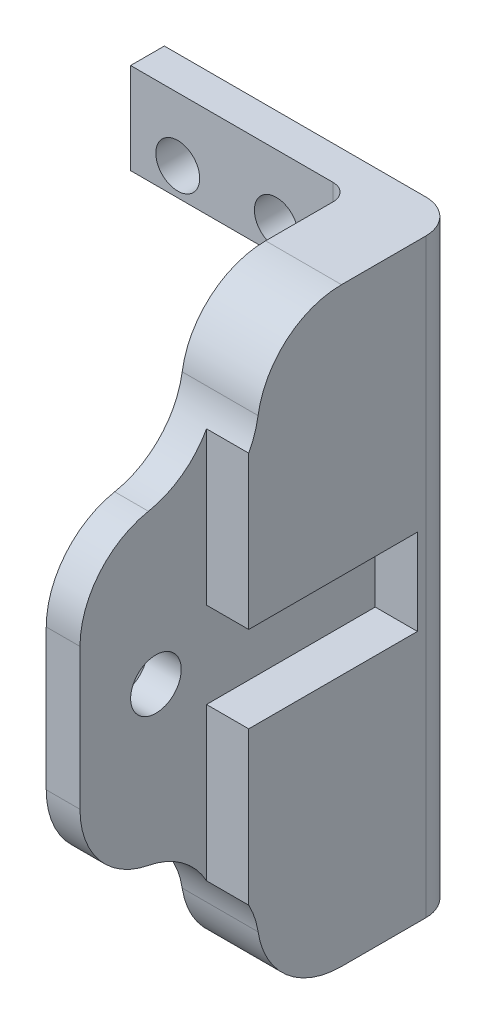
ISO-10303-21;
HEADER;
FILE_DESCRIPTION(('STEP AP214'),'2;1');
FILE_NAME('part.step','',(''),(''),'','','');
FILE_SCHEMA(('AUTOMOTIVE_DESIGN { 1 0 10303 214 1 1 1 1 }'));
ENDSEC;
DATA;
#1=APPLICATION_CONTEXT('core data for automotive mechanical design processes');
#2=APPLICATION_PROTOCOL_DEFINITION('international standard','automotive_design',2000,#1);
#3=PRODUCT_CONTEXT('',#1,'mechanical');
#4=PRODUCT('Part','Part','',(#3));
#5=PRODUCT_RELATED_PRODUCT_CATEGORY('part','',(#4));
#6=PRODUCT_DEFINITION_FORMATION('','',#4);
#7=PRODUCT_DEFINITION_CONTEXT('part definition',#1,'design');
#8=PRODUCT_DEFINITION('design','',#6,#7);
#9=PRODUCT_DEFINITION_SHAPE('','',#8);
#10=(LENGTH_UNIT() NAMED_UNIT(*) SI_UNIT(.MILLI.,.METRE.));
#11=(NAMED_UNIT(*) PLANE_ANGLE_UNIT() SI_UNIT($,.RADIAN.));
#12=(NAMED_UNIT(*) SI_UNIT($,.STERADIAN.) SOLID_ANGLE_UNIT());
#13=UNCERTAINTY_MEASURE_WITH_UNIT(LENGTH_MEASURE(1.E-05),#10,'distance_accuracy_value','');
#14=(GEOMETRIC_REPRESENTATION_CONTEXT(3) GLOBAL_UNCERTAINTY_ASSIGNED_CONTEXT((#13)) GLOBAL_UNIT_ASSIGNED_CONTEXT((#10,
#11,#12)) REPRESENTATION_CONTEXT('',''));
#15=CARTESIAN_POINT('',(0.,0.,0.));
#16=DIRECTION('',(0.,0.,1.));
#17=DIRECTION('',(1.,0.,0.));
#18=AXIS2_PLACEMENT_3D('',#15,#16,#17);
#19=CARTESIAN_POINT('',(17.5,20.05,2.5));
#20=DIRECTION('',(0.,-1.,0.));
#21=DIRECTION('',(0.,0.,1.));
#22=AXIS2_PLACEMENT_3D('',#19,#20,#21);
#23=PLANE('',#22);
#24=DIRECTION('',(0.,0.,1.));
#25=VECTOR('',#24,1.);
#26=CARTESIAN_POINT('',(15.,20.05,11.25));
#27=LINE('',#26,#25);
#28=CARTESIAN_POINT('',(15.,20.05,2.5));
#29=VERTEX_POINT('',#28);
#30=CARTESIAN_POINT('',(15.,20.05,12.5));
#31=VERTEX_POINT('',#30);
#32=EDGE_CURVE('E341',#29,#31,#27,.T.);
#33=ORIENTED_EDGE('',*,*,#32,.F.);
#34=DIRECTION('',(-1.,0.,0.));
#35=VECTOR('',#34,1.);
#36=CARTESIAN_POINT('',(16.25,20.05,2.5));
#37=LINE('',#36,#35);
#38=CARTESIAN_POINT('',(17.5,20.05,2.5));
#39=VERTEX_POINT('',#38);
#40=EDGE_CURVE('E369',#39,#29,#37,.T.);
#41=ORIENTED_EDGE('',*,*,#40,.F.);
#42=DIRECTION('',(0.,0.,-1.));
#43=VECTOR('',#42,1.);
#44=CARTESIAN_POINT('',(17.5,20.05,7.25));
#45=LINE('',#44,#43);
#46=CARTESIAN_POINT('',(17.5,20.05,12.5));
#47=VERTEX_POINT('',#46);
#48=EDGE_CURVE('E324',#47,#39,#45,.T.);
#49=ORIENTED_EDGE('',*,*,#48,.F.);
#50=DIRECTION('',(1.,0.,0.));
#51=VECTOR('',#50,1.);
#52=CARTESIAN_POINT('',(16.25,20.05,12.5));
#53=LINE('',#52,#51);
#54=EDGE_CURVE('E347',#31,#47,#53,.T.);
#55=ORIENTED_EDGE('',*,*,#54,.F.);
#56=EDGE_LOOP('',(#33,#41,#49,#55));
#57=FACE_BOUND('',#56,.T.);
#58=ADVANCED_FACE('F16',(#57),#23,.T.);
#59=CARTESIAN_POINT('',(17.5,14.95,2.5));
#60=DIRECTION('',(0.,0.,1.));
#61=DIRECTION('',(0.,1.,0.));
#62=AXIS2_PLACEMENT_3D('',#59,#60,#61);
#63=PLANE('',#62);
#64=DIRECTION('',(0.,1.,0.));
#65=VECTOR('',#64,1.);
#66=CARTESIAN_POINT('',(15.,17.5,2.5));
#67=LINE('',#66,#65);
#68=CARTESIAN_POINT('',(15.,14.95,2.5));
#69=VERTEX_POINT('',#68);
#70=EDGE_CURVE('E383',#69,#29,#67,.T.);
#71=ORIENTED_EDGE('',*,*,#70,.F.);
#72=DIRECTION('',(-1.,0.,0.));
#73=VECTOR('',#72,1.);
#74=CARTESIAN_POINT('',(16.25,14.95,2.5));
#75=LINE('',#74,#73);
#76=CARTESIAN_POINT('',(17.5,14.95,2.5));
#77=VERTEX_POINT('',#76);
#78=EDGE_CURVE('E362',#77,#69,#75,.T.);
#79=ORIENTED_EDGE('',*,*,#78,.F.);
#80=DIRECTION('',(0.,-1.,0.));
#81=VECTOR('',#80,1.);
#82=CARTESIAN_POINT('',(17.5,17.5,2.5));
#83=LINE('',#82,#81);
#84=EDGE_CURVE('E366',#39,#77,#83,.T.);
#85=ORIENTED_EDGE('',*,*,#84,.F.);
#86=ORIENTED_EDGE('',*,*,#40,.T.);
#87=EDGE_LOOP('',(#71,#79,#85,#86));
#88=FACE_BOUND('',#87,.T.);
#89=ADVANCED_FACE('F529',(#88),#63,.T.);
#90=CARTESIAN_POINT('',(17.5,14.95,12.5));
#91=DIRECTION('',(0.,1.,0.));
#92=DIRECTION('',(0.,0.,-1.));
#93=AXIS2_PLACEMENT_3D('',#90,#91,#92);
#94=PLANE('',#93);
#95=DIRECTION('',(0.,0.,-1.));
#96=VECTOR('',#95,1.);
#97=CARTESIAN_POINT('',(15.,14.95,11.25));
#98=LINE('',#97,#96);
#99=CARTESIAN_POINT('',(15.,14.95,12.5));
#100=VERTEX_POINT('',#99);
#101=EDGE_CURVE('E346',#100,#69,#98,.T.);
#102=ORIENTED_EDGE('',*,*,#101,.F.);
#103=DIRECTION('',(-1.,0.,0.));
#104=VECTOR('',#103,1.);
#105=CARTESIAN_POINT('',(16.25,14.95,12.5));
#106=LINE('',#105,#104);
#107=CARTESIAN_POINT('',(17.5,14.95,12.5));
#108=VERTEX_POINT('',#107);
#109=EDGE_CURVE('E359',#108,#100,#106,.T.);
#110=ORIENTED_EDGE('',*,*,#109,.F.);
#111=DIRECTION('',(0.,0.,1.));
#112=VECTOR('',#111,1.);
#113=CARTESIAN_POINT('',(17.5,14.95,7.25));
#114=LINE('',#113,#112);
#115=EDGE_CURVE('E319',#77,#108,#114,.T.);
#116=ORIENTED_EDGE('',*,*,#115,.F.);
#117=ORIENTED_EDGE('',*,*,#78,.T.);
#118=EDGE_LOOP('',(#102,#110,#116,#117));
#119=FACE_BOUND('',#118,.T.);
#120=ADVANCED_FACE('F532',(#119),#94,.T.);
#121=CARTESIAN_POINT('',(17.5,5.89905390374384,12.5));
#122=DIRECTION('',(0.,0.,1.));
#123=DIRECTION('',(0.,1.,0.));
#124=AXIS2_PLACEMENT_3D('',#121,#122,#123);
#125=PLANE('',#124);
#126=ORIENTED_EDGE('',*,*,#109,.T.);
#127=DIRECTION('',(0.,1.,0.));
#128=VECTOR('',#127,1.);
#129=CARTESIAN_POINT('',(15.,17.5,12.5));
#130=LINE('',#129,#128);
#131=CARTESIAN_POINT('',(15.,5.89905390374383,12.5));
#132=VERTEX_POINT('',#131);
#133=EDGE_CURVE('E342',#132,#100,#130,.T.);
#134=ORIENTED_EDGE('',*,*,#133,.F.);
#135=DIRECTION('',(-1.,0.,0.));
#136=VECTOR('',#135,1.);
#137=CARTESIAN_POINT('',(15.25,5.89905390374384,12.5));
#138=LINE('',#137,#136);
#139=CARTESIAN_POINT('',(17.5,5.89905390374383,12.5));
#140=VERTEX_POINT('',#139);
#141=EDGE_CURVE('E355',#140,#132,#138,.T.);
#142=ORIENTED_EDGE('',*,*,#141,.F.);
#143=DIRECTION('',(0.,-1.,0.));
#144=VECTOR('',#143,1.);
#145=CARTESIAN_POINT('',(17.5,17.5,12.5));
#146=LINE('',#145,#144);
#147=EDGE_CURVE('E314',#108,#140,#146,.T.);
#148=ORIENTED_EDGE('',*,*,#147,.F.);
#149=EDGE_LOOP('',(#126,#134,#142,#148));
#150=FACE_BOUND('',#149,.T.);
#151=ADVANCED_FACE('F534',(#150),#125,.T.);
#152=CARTESIAN_POINT('',(17.5,20.05,12.5));
#153=DIRECTION('',(0.,0.,1.));
#154=DIRECTION('',(0.,1.,0.));
#155=AXIS2_PLACEMENT_3D('',#152,#153,#154);
#156=PLANE('',#155);
#157=ORIENTED_EDGE('',*,*,#54,.T.);
#158=DIRECTION('',(0.,-1.,0.));
#159=VECTOR('',#158,1.);
#160=CARTESIAN_POINT('',(17.5,17.5,12.5));
#161=LINE('',#160,#159);
#162=CARTESIAN_POINT('',(17.5,29.1009460962562,12.5));
#163=VERTEX_POINT('',#162);
#164=EDGE_CURVE('E320',#163,#47,#161,.T.);
#165=ORIENTED_EDGE('',*,*,#164,.F.);
#166=DIRECTION('',(1.,0.,0.));
#167=VECTOR('',#166,1.);
#168=CARTESIAN_POINT('',(15.25,29.1009460962562,12.5));
#169=LINE('',#168,#167);
#170=CARTESIAN_POINT('',(15.,29.1009460962562,12.5));
#171=VERTEX_POINT('',#170);
#172=EDGE_CURVE('E348',#171,#163,#169,.T.);
#173=ORIENTED_EDGE('',*,*,#172,.F.);
#174=DIRECTION('',(0.,1.,0.));
#175=VECTOR('',#174,1.);
#176=CARTESIAN_POINT('',(15.,17.5,12.5));
#177=LINE('',#176,#175);
#178=EDGE_CURVE('E327',#31,#171,#177,.T.);
#179=ORIENTED_EDGE('',*,*,#178,.F.);
#180=EDGE_LOOP('',(#157,#165,#173,#179));
#181=FACE_BOUND('',#180,.T.);
#182=ADVANCED_FACE('F521',(#181),#156,.T.);
#183=CARTESIAN_POINT('',(15.,5.89905390374384,20.));
#184=DIRECTION('',(1.,0.,0.));
#185=DIRECTION('',(0.,0.,-1.));
#186=AXIS2_PLACEMENT_3D('',#183,#184,#185);
#187=PLANE('',#186);
#188=CARTESIAN_POINT('',(15.,17.5,15.5));
#189=DIRECTION('',(-1.,0.,0.));
#190=DIRECTION('',(0.,0.,1.));
#191=AXIS2_PLACEMENT_3D('',#188,#189,#190);
#192=CIRCLE('',#191,1.5);
#193=CARTESIAN_POINT('',(15.,17.5,17.));
#194=VERTEX_POINT('',#193);
#195=EDGE_CURVE('E459',#194,#194,#192,.F.);
#196=ORIENTED_EDGE('',*,*,#195,.F.);
#197=EDGE_LOOP('',(#196));
#198=FACE_BOUND('',#197,.T.);
#199=DIRECTION('',(0.,1.,0.));
#200=VECTOR('',#199,1.);
#201=CARTESIAN_POINT('',(15.,17.5,20.));
#202=LINE('',#201,#200);
#203=CARTESIAN_POINT('',(15.,13.3203747110933,20.));
#204=VERTEX_POINT('',#203);
#205=CARTESIAN_POINT('',(15.,21.6796252889067,20.));
#206=VERTEX_POINT('',#205);
#207=EDGE_CURVE('E295',#204,#206,#202,.T.);
#208=ORIENTED_EDGE('',*,*,#207,.F.);
#209=CARTESIAN_POINT('',(15.,13.3203747110933,15.));
#210=DIRECTION('',(-1.,0.,0.));
#211=DIRECTION('',(0.,0.,1.));
#212=AXIS2_PLACEMENT_3D('',#209,#210,#211);
#213=CIRCLE('',#212,4.99999999999998);
#214=CARTESIAN_POINT('',(15.,8.41018735554666,15.9434299833213));
#215=VERTEX_POINT('',#214);
#216=EDGE_CURVE('E300',#215,#204,#213,.T.);
#217=ORIENTED_EDGE('',*,*,#216,.F.);
#218=CARTESIAN_POINT('',(15.,3.50000000000003,16.8868599666426));
#219=DIRECTION('',(-1.,0.,0.));
#220=DIRECTION('',(0.,0.,1.));
#221=AXIS2_PLACEMENT_3D('',#218,#219,#220);
#222=CIRCLE('',#221,4.99999999999999);
#223=EDGE_CURVE('E306',#132,#215,#222,.F.);
#224=ORIENTED_EDGE('',*,*,#223,.F.);
#225=ORIENTED_EDGE('',*,*,#133,.T.);
#226=ORIENTED_EDGE('',*,*,#101,.T.);
#227=ORIENTED_EDGE('',*,*,#70,.T.);
#228=ORIENTED_EDGE('',*,*,#32,.T.);
#229=ORIENTED_EDGE('',*,*,#178,.T.);
#230=CARTESIAN_POINT('',(15.,31.5,16.8868599666426));
#231=DIRECTION('',(1.,0.,0.));
#232=DIRECTION('',(0.,0.,-1.));
#233=AXIS2_PLACEMENT_3D('',#230,#231,#232);
#234=CIRCLE('',#233,4.99999999999999);
#235=CARTESIAN_POINT('',(15.,26.5898126444533,15.9434299833213));
#236=VERTEX_POINT('',#235);
#237=EDGE_CURVE('E289',#236,#171,#234,.T.);
#238=ORIENTED_EDGE('',*,*,#237,.F.);
#239=CARTESIAN_POINT('',(15.,21.6796252889067,15.0000000000001));
#240=DIRECTION('',(1.,0.,0.));
#241=DIRECTION('',(0.,0.,-1.));
#242=AXIS2_PLACEMENT_3D('',#239,#240,#241);
#243=CIRCLE('',#242,4.99999999999993);
#244=EDGE_CURVE('E290',#206,#236,#243,.F.);
#245=ORIENTED_EDGE('',*,*,#244,.F.);
#246=EDGE_LOOP('',(#208,#217,#224,#225,#226,#227,#228,#229,#238,#245));
#247=FACE_BOUND('',#246,.T.);
#248=ADVANCED_FACE('F536',(#198,#247),#187,.T.);
#249=CARTESIAN_POINT('',(15.5,35.,2.));
#250=DIRECTION('',(0.,-1.,0.));
#251=DIRECTION('',(0.,0.,-1.));
#252=AXIS2_PLACEMENT_3D('',#249,#250,#251);
#253=CYLINDRICAL_SURFACE('',#252,2.00000000000001);
#254=CARTESIAN_POINT('',(15.5,0.,2.));
#255=DIRECTION('',(0.,-1.,0.));
#256=DIRECTION('',(0.,0.,-1.));
#257=AXIS2_PLACEMENT_3D('',#254,#255,#256);
#258=CIRCLE('',#257,2.00000000000001);
#259=CARTESIAN_POINT('',(15.5,0.,0.));
#260=VERTEX_POINT('',#259);
#261=CARTESIAN_POINT('',(17.5,0.,2.));
#262=VERTEX_POINT('',#261);
#263=EDGE_CURVE('E99',#260,#262,#258,.T.);
#264=ORIENTED_EDGE('',*,*,#263,.F.);
#265=DIRECTION('',(0.,-1.,0.));
#266=VECTOR('',#265,1.);
#267=CARTESIAN_POINT('',(15.5,17.5,0.));
#268=LINE('',#267,#266);
#269=CARTESIAN_POINT('',(15.5,35.,0.));
#270=VERTEX_POINT('',#269);
#271=EDGE_CURVE('E311',#270,#260,#268,.T.);
#272=ORIENTED_EDGE('',*,*,#271,.F.);
#273=CARTESIAN_POINT('',(15.5,35.,2.));
#274=DIRECTION('',(0.,-1.,0.));
#275=DIRECTION('',(0.,0.,-1.));
#276=AXIS2_PLACEMENT_3D('',#273,#274,#275);
#277=CIRCLE('',#276,2.00000000000001);
#278=CARTESIAN_POINT('',(17.5,35.,2.));
#279=VERTEX_POINT('',#278);
#280=EDGE_CURVE('E268',#279,#270,#277,.F.);
#281=ORIENTED_EDGE('',*,*,#280,.F.);
#282=DIRECTION('',(0.,1.,0.));
#283=VECTOR('',#282,1.);
#284=CARTESIAN_POINT('',(17.5,17.5,2.));
#285=LINE('',#284,#283);
#286=EDGE_CURVE('E96',#262,#279,#285,.T.);
#287=ORIENTED_EDGE('',*,*,#286,.F.);
#288=EDGE_LOOP('',(#264,#272,#281,#287));
#289=FACE_BOUND('',#288,.T.);
#290=ADVANCED_FACE('F563',(#289),#253,.T.);
#291=CARTESIAN_POINT('',(17.5,0.,2.));
#292=DIRECTION('',(1.,0.,0.));
#293=DIRECTION('',(0.,1.,0.));
#294=AXIS2_PLACEMENT_3D('',#291,#292,#293);
#295=PLANE('',#294);
#296=CARTESIAN_POINT('',(17.5,5.00000000000006,6.99999999999996));
#297=DIRECTION('',(-1.,0.,0.));
#298=DIRECTION('',(0.,0.,1.));
#299=AXIS2_PLACEMENT_3D('',#296,#297,#298);
#300=CIRCLE('',#299,4.99999999999995);
#301=CARTESIAN_POINT('',(17.5,0.,6.99999999999998));
#302=VERTEX_POINT('',#301);
#303=CARTESIAN_POINT('',(17.5,4.25000000000003,11.9434299833213));
#304=VERTEX_POINT('',#303);
#305=EDGE_CURVE('E20',#302,#304,#300,.T.);
#306=ORIENTED_EDGE('',*,*,#305,.F.);
#307=DIRECTION('',(0.,0.,1.));
#308=VECTOR('',#307,1.);
#309=CARTESIAN_POINT('',(17.5,0.,3.5));
#310=LINE('',#309,#308);
#311=EDGE_CURVE('E310',#262,#302,#310,.T.);
#312=ORIENTED_EDGE('',*,*,#311,.F.);
#313=ORIENTED_EDGE('',*,*,#286,.T.);
#314=DIRECTION('',(0.,0.,-1.));
#315=VECTOR('',#314,1.);
#316=CARTESIAN_POINT('',(17.5,35.,3.5));
#317=LINE('',#316,#315);
#318=CARTESIAN_POINT('',(17.5,35.,6.99999999999998));
#319=VERTEX_POINT('',#318);
#320=EDGE_CURVE('E256',#319,#279,#317,.T.);
#321=ORIENTED_EDGE('',*,*,#320,.F.);
#322=CARTESIAN_POINT('',(17.5,29.9999999999999,6.99999999999996));
#323=DIRECTION('',(1.,0.,0.));
#324=DIRECTION('',(0.,0.,-1.));
#325=AXIS2_PLACEMENT_3D('',#322,#323,#324);
#326=CIRCLE('',#325,4.99999999999992);
#327=CARTESIAN_POINT('',(17.5,30.75,11.9434299833213));
#328=VERTEX_POINT('',#327);
#329=EDGE_CURVE('E279',#328,#319,#326,.F.);
#330=ORIENTED_EDGE('',*,*,#329,.F.);
#331=CARTESIAN_POINT('',(17.5,31.5,16.8868599666426));
#332=DIRECTION('',(1.,0.,0.));
#333=DIRECTION('',(0.,0.,-1.));
#334=AXIS2_PLACEMENT_3D('',#331,#332,#333);
#335=CIRCLE('',#334,4.99999999999999);
#336=EDGE_CURVE('E284',#163,#328,#335,.T.);
#337=ORIENTED_EDGE('',*,*,#336,.F.);
#338=ORIENTED_EDGE('',*,*,#164,.T.);
#339=ORIENTED_EDGE('',*,*,#48,.T.);
#340=ORIENTED_EDGE('',*,*,#84,.T.);
#341=ORIENTED_EDGE('',*,*,#115,.T.);
#342=ORIENTED_EDGE('',*,*,#147,.T.);
#343=CARTESIAN_POINT('',(17.5,3.50000000000003,16.8868599666426));
#344=DIRECTION('',(-1.,0.,0.));
#345=DIRECTION('',(0.,0.,1.));
#346=AXIS2_PLACEMENT_3D('',#343,#344,#345);
#347=CIRCLE('',#346,4.99999999999999);
#348=EDGE_CURVE('E305',#304,#140,#347,.F.);
#349=ORIENTED_EDGE('',*,*,#348,.F.);
#350=EDGE_LOOP('',(#306,#312,#313,#321,#330,#337,#338,#339,#340,#341,#342,#349));
#351=FACE_BOUND('',#350,.T.);
#352=ADVANCED_FACE('F488',(#351),#295,.T.);
#353=CARTESIAN_POINT('',(15.5,0.,0.));
#354=DIRECTION('',(0.,0.,-1.));
#355=DIRECTION('',(-1.,0.,0.));
#356=AXIS2_PLACEMENT_3D('',#353,#354,#355);
#357=PLANE('',#356);
#358=CARTESIAN_POINT('',(2.83639967795365,3.75,0.));
#359=DIRECTION('',(0.,0.,-1.));
#360=DIRECTION('',(-1.,0.,0.));
#361=AXIS2_PLACEMENT_3D('',#358,#359,#360);
#362=CIRCLE('',#361,1.3);
#363=CARTESIAN_POINT('',(1.53639967795365,3.75,0.));
#364=VERTEX_POINT('',#363);
#365=EDGE_CURVE('E434',#364,#364,#362,.T.);
#366=ORIENTED_EDGE('',*,*,#365,.F.);
#367=EDGE_LOOP('',(#366));
#368=FACE_BOUND('',#367,.T.);
#369=CARTESIAN_POINT('',(2.79399999999999,31.25,0.));
#370=DIRECTION('',(0.,0.,-1.));
#371=DIRECTION('',(-1.,0.,0.));
#372=AXIS2_PLACEMENT_3D('',#369,#370,#371);
#373=CIRCLE('',#372,1.3);
#374=CARTESIAN_POINT('',(1.49399999999999,31.25,0.));
#375=VERTEX_POINT('',#374);
#376=EDGE_CURVE('E438',#375,#375,#373,.T.);
#377=ORIENTED_EDGE('',*,*,#376,.F.);
#378=EDGE_LOOP('',(#377));
#379=FACE_BOUND('',#378,.T.);
#380=CARTESIAN_POINT('',(8.63599999999999,31.25,0.));
#381=DIRECTION('',(0.,0.,-1.));
#382=DIRECTION('',(-1.,0.,0.));
#383=AXIS2_PLACEMENT_3D('',#380,#381,#382);
#384=CIRCLE('',#383,1.3);
#385=CARTESIAN_POINT('',(7.33599999999999,31.25,0.));
#386=VERTEX_POINT('',#385);
#387=EDGE_CURVE('E442',#386,#386,#384,.T.);
#388=ORIENTED_EDGE('',*,*,#387,.F.);
#389=EDGE_LOOP('',(#388));
#390=FACE_BOUND('',#389,.T.);
#391=CARTESIAN_POINT('',(8.59360032204635,3.75,0.));
#392=DIRECTION('',(0.,0.,-1.));
#393=DIRECTION('',(-1.,0.,0.));
#394=AXIS2_PLACEMENT_3D('',#391,#392,#393);
#395=CIRCLE('',#394,1.3);
#396=CARTESIAN_POINT('',(7.29360032204635,3.75,0.));
#397=VERTEX_POINT('',#396);
#398=EDGE_CURVE('E446',#397,#397,#395,.T.);
#399=ORIENTED_EDGE('',*,*,#398,.F.);
#400=EDGE_LOOP('',(#399));
#401=FACE_BOUND('',#400,.T.);
#402=DIRECTION('',(0.,-1.,0.));
#403=VECTOR('',#402,1.);
#404=CARTESIAN_POINT('',(0.,32.3,0.));
#405=LINE('',#404,#403);
#406=CARTESIAN_POINT('',(0.,35.,0.));
#407=VERTEX_POINT('',#406);
#408=CARTESIAN_POINT('',(0.,29.6,0.));
#409=VERTEX_POINT('',#408);
#410=EDGE_CURVE('E255',#407,#409,#405,.T.);
#411=ORIENTED_EDGE('',*,*,#410,.F.);
#412=DIRECTION('',(-1.,0.,0.));
#413=VECTOR('',#412,1.);
#414=CARTESIAN_POINT('',(8.75,35.,0.));
#415=LINE('',#414,#413);
#416=EDGE_CURVE('E265',#270,#407,#415,.T.);
#417=ORIENTED_EDGE('',*,*,#416,.F.);
#418=ORIENTED_EDGE('',*,*,#271,.T.);
#419=DIRECTION('',(1.,0.,0.));
#420=VECTOR('',#419,1.);
#421=CARTESIAN_POINT('',(8.75,0.,0.));
#422=LINE('',#421,#420);
#423=CARTESIAN_POINT('',(0.,0.,0.));
#424=VERTEX_POINT('',#423);
#425=EDGE_CURVE('E199',#424,#260,#422,.T.);
#426=ORIENTED_EDGE('',*,*,#425,.F.);
#427=DIRECTION('',(0.,-1.,0.));
#428=VECTOR('',#427,1.);
#429=CARTESIAN_POINT('',(0.,2.7,0.));
#430=LINE('',#429,#428);
#431=CARTESIAN_POINT('',(0.,5.4,0.));
#432=VERTEX_POINT('',#431);
#433=EDGE_CURVE('E194',#432,#424,#430,.T.);
#434=ORIENTED_EDGE('',*,*,#433,.F.);
#435=DIRECTION('',(-1.,0.,0.));
#436=VECTOR('',#435,1.);
#437=CARTESIAN_POINT('',(5.715,5.4,0.));
#438=LINE('',#437,#436);
#439=CARTESIAN_POINT('',(11.43,5.4,0.));
#440=VERTEX_POINT('',#439);
#441=EDGE_CURVE('E229',#440,#432,#438,.T.);
#442=ORIENTED_EDGE('',*,*,#441,.F.);
#443=DIRECTION('',(0.,-1.,0.));
#444=VECTOR('',#443,1.);
#445=CARTESIAN_POINT('',(11.43,17.5,0.));
#446=LINE('',#445,#444);
#447=CARTESIAN_POINT('',(11.43,29.6,0.));
#448=VERTEX_POINT('',#447);
#449=EDGE_CURVE('E237',#448,#440,#446,.T.);
#450=ORIENTED_EDGE('',*,*,#449,.F.);
#451=DIRECTION('',(1.,0.,0.));
#452=VECTOR('',#451,1.);
#453=CARTESIAN_POINT('',(5.715,29.6,0.));
#454=LINE('',#453,#452);
#455=EDGE_CURVE('E246',#409,#448,#454,.T.);
#456=ORIENTED_EDGE('',*,*,#455,.F.);
#457=EDGE_LOOP('',(#411,#417,#418,#426,#434,#442,#450,#456));
#458=FACE_BOUND('',#457,.T.);
#459=ADVANCED_FACE('F562',(#368,#379,#390,#401,#458),#357,.T.);
#460=CARTESIAN_POINT('',(17.5,5.00000000000006,6.99999999999996));
#461=DIRECTION('',(-1.,0.,0.));
#462=DIRECTION('',(0.,0.,1.));
#463=AXIS2_PLACEMENT_3D('',#460,#461,#462);
#464=CYLINDRICAL_SURFACE('',#463,4.99999999999995);
#465=DIRECTION('',(-1.,0.,0.));
#466=VECTOR('',#465,1.);
#467=CARTESIAN_POINT('',(8.75,0.,7.));
#468=LINE('',#467,#466);
#469=CARTESIAN_POINT('',(13.,0.,6.99999999999998));
#470=VERTEX_POINT('',#469);
#471=EDGE_CURVE('E307',#302,#470,#468,.T.);
#472=ORIENTED_EDGE('',*,*,#471,.F.);
#473=ORIENTED_EDGE('',*,*,#305,.T.);
#474=DIRECTION('',(1.,0.,0.));
#475=VECTOR('',#474,1.);
#476=CARTESIAN_POINT('',(15.25,4.25,11.9434299833213));
#477=LINE('',#476,#475);
#478=CARTESIAN_POINT('',(13.,4.25000000000002,11.9434299833213));
#479=VERTEX_POINT('',#478);
#480=EDGE_CURVE('E301',#479,#304,#477,.T.);
#481=ORIENTED_EDGE('',*,*,#480,.F.);
#482=CARTESIAN_POINT('',(13.,5.00000000000006,6.99999999999996));
#483=DIRECTION('',(-1.,0.,0.));
#484=DIRECTION('',(0.,0.,1.));
#485=AXIS2_PLACEMENT_3D('',#482,#483,#484);
#486=CIRCLE('',#485,4.99999999999995);
#487=EDGE_CURVE('E429',#470,#479,#486,.T.);
#488=ORIENTED_EDGE('',*,*,#487,.F.);
#489=EDGE_LOOP('',(#472,#473,#481,#488));
#490=FACE_BOUND('',#489,.T.);
#491=ADVANCED_FACE('F484',(#490),#464,.T.);
#492=CARTESIAN_POINT('',(17.5,3.50000000000003,16.8868599666426));
#493=DIRECTION('',(-1.,0.,0.));
#494=DIRECTION('',(0.,0.,1.));
#495=AXIS2_PLACEMENT_3D('',#492,#493,#494);
#496=CYLINDRICAL_SURFACE('',#495,4.99999999999999);
#497=ORIENTED_EDGE('',*,*,#348,.T.);
#498=ORIENTED_EDGE('',*,*,#141,.T.);
#499=ORIENTED_EDGE('',*,*,#223,.T.);
#500=DIRECTION('',(1.,0.,0.));
#501=VECTOR('',#500,1.);
#502=CARTESIAN_POINT('',(14.,8.41018735554667,15.9434299833213));
#503=LINE('',#502,#501);
#504=CARTESIAN_POINT('',(13.,8.41018735554666,15.9434299833213));
#505=VERTEX_POINT('',#504);
#506=EDGE_CURVE('E296',#505,#215,#503,.T.);
#507=ORIENTED_EDGE('',*,*,#506,.F.);
#508=CARTESIAN_POINT('',(13.,3.50000000000003,16.8868599666426));
#509=DIRECTION('',(-1.,0.,0.));
#510=DIRECTION('',(0.,0.,1.));
#511=AXIS2_PLACEMENT_3D('',#508,#509,#510);
#512=CIRCLE('',#511,4.99999999999999);
#513=EDGE_CURVE('E425',#479,#505,#512,.F.);
#514=ORIENTED_EDGE('',*,*,#513,.F.);
#515=ORIENTED_EDGE('',*,*,#480,.T.);
#516=EDGE_LOOP('',(#497,#498,#499,#507,#514,#515));
#517=FACE_BOUND('',#516,.T.);
#518=ADVANCED_FACE('F491',(#517),#496,.F.);
#519=CARTESIAN_POINT('',(15.,13.3203747110933,15.));
#520=DIRECTION('',(-1.,0.,0.));
#521=DIRECTION('',(0.,0.,1.));
#522=AXIS2_PLACEMENT_3D('',#519,#520,#521);
#523=CYLINDRICAL_SURFACE('',#522,4.99999999999998);
#524=CARTESIAN_POINT('',(13.,13.3203747110933,15.));
#525=DIRECTION('',(-1.,0.,0.));
#526=DIRECTION('',(0.,0.,1.));
#527=AXIS2_PLACEMENT_3D('',#524,#525,#526);
#528=CIRCLE('',#527,4.99999999999998);
#529=CARTESIAN_POINT('',(13.,13.3203747110933,20.));
#530=VERTEX_POINT('',#529);
#531=EDGE_CURVE('E421',#505,#530,#528,.T.);
#532=ORIENTED_EDGE('',*,*,#531,.F.);
#533=ORIENTED_EDGE('',*,*,#506,.T.);
#534=ORIENTED_EDGE('',*,*,#216,.T.);
#535=DIRECTION('',(1.,0.,0.));
#536=VECTOR('',#535,1.);
#537=CARTESIAN_POINT('',(14.,13.3203747110933,20.));
#538=LINE('',#537,#536);
#539=EDGE_CURVE('E291',#530,#204,#538,.T.);
#540=ORIENTED_EDGE('',*,*,#539,.F.);
#541=EDGE_LOOP('',(#532,#533,#534,#540));
#542=FACE_BOUND('',#541,.T.);
#543=ADVANCED_FACE('F538',(#542),#523,.T.);
#544=CARTESIAN_POINT('',(13.,13.3203747110933,20.));
#545=DIRECTION('',(0.,0.,1.));
#546=DIRECTION('',(1.,0.,0.));
#547=AXIS2_PLACEMENT_3D('',#544,#545,#546);
#548=PLANE('',#547);
#549=DIRECTION('',(0.,1.,0.));
#550=VECTOR('',#549,1.);
#551=CARTESIAN_POINT('',(13.,17.5,20.));
#552=LINE('',#551,#550);
#553=CARTESIAN_POINT('',(13.,21.6796252889067,20.));
#554=VERTEX_POINT('',#553);
#555=EDGE_CURVE('E420',#530,#554,#552,.T.);
#556=ORIENTED_EDGE('',*,*,#555,.F.);
#557=ORIENTED_EDGE('',*,*,#539,.T.);
#558=ORIENTED_EDGE('',*,*,#207,.T.);
#559=DIRECTION('',(1.,0.,0.));
#560=VECTOR('',#559,1.);
#561=CARTESIAN_POINT('',(14.,21.6796252889067,20.));
#562=LINE('',#561,#560);
#563=EDGE_CURVE('E285',#554,#206,#562,.T.);
#564=ORIENTED_EDGE('',*,*,#563,.F.);
#565=EDGE_LOOP('',(#556,#557,#558,#564));
#566=FACE_BOUND('',#565,.T.);
#567=ADVANCED_FACE('F541',(#566),#548,.T.);
#568=CARTESIAN_POINT('',(13.,21.6796252889067,15.0000000000001));
#569=DIRECTION('',(1.,0.,0.));
#570=DIRECTION('',(0.,0.,-1.));
#571=AXIS2_PLACEMENT_3D('',#568,#569,#570);
#572=CYLINDRICAL_SURFACE('',#571,4.99999999999993);
#573=CARTESIAN_POINT('',(13.,21.6796252889067,15.0000000000001));
#574=DIRECTION('',(1.,0.,0.));
#575=DIRECTION('',(0.,0.,-1.));
#576=AXIS2_PLACEMENT_3D('',#573,#574,#575);
#577=CIRCLE('',#576,4.99999999999993);
#578=CARTESIAN_POINT('',(13.,26.5898126444533,15.9434299833213));
#579=VERTEX_POINT('',#578);
#580=EDGE_CURVE('E416',#554,#579,#577,.F.);
#581=ORIENTED_EDGE('',*,*,#580,.F.);
#582=ORIENTED_EDGE('',*,*,#563,.T.);
#583=ORIENTED_EDGE('',*,*,#244,.T.);
#584=DIRECTION('',(1.,0.,0.));
#585=VECTOR('',#584,1.);
#586=CARTESIAN_POINT('',(15.25,26.5898126444533,15.9434299833213));
#587=LINE('',#586,#585);
#588=EDGE_CURVE('E280',#579,#236,#587,.T.);
#589=ORIENTED_EDGE('',*,*,#588,.F.);
#590=EDGE_LOOP('',(#581,#582,#583,#589));
#591=FACE_BOUND('',#590,.T.);
#592=ADVANCED_FACE('F624',(#591),#572,.T.);
#593=CARTESIAN_POINT('',(13.,31.5,16.8868599666426));
#594=DIRECTION('',(1.,0.,0.));
#595=DIRECTION('',(0.,0.,-1.));
#596=AXIS2_PLACEMENT_3D('',#593,#594,#595);
#597=CYLINDRICAL_SURFACE('',#596,4.99999999999999);
#598=CARTESIAN_POINT('',(13.,31.5,16.8868599666426));
#599=DIRECTION('',(1.,0.,0.));
#600=DIRECTION('',(0.,0.,-1.));
#601=AXIS2_PLACEMENT_3D('',#598,#599,#600);
#602=CIRCLE('',#601,4.99999999999999);
#603=CARTESIAN_POINT('',(13.,30.75,11.9434299833212));
#604=VERTEX_POINT('',#603);
#605=EDGE_CURVE('E412',#579,#604,#602,.T.);
#606=ORIENTED_EDGE('',*,*,#605,.F.);
#607=ORIENTED_EDGE('',*,*,#588,.T.);
#608=ORIENTED_EDGE('',*,*,#237,.T.);
#609=ORIENTED_EDGE('',*,*,#172,.T.);
#610=ORIENTED_EDGE('',*,*,#336,.T.);
#611=DIRECTION('',(1.,0.,0.));
#612=VECTOR('',#611,1.);
#613=CARTESIAN_POINT('',(15.25,30.75,11.9434299833213));
#614=LINE('',#613,#612);
#615=EDGE_CURVE('E275',#604,#328,#614,.T.);
#616=ORIENTED_EDGE('',*,*,#615,.F.);
#617=EDGE_LOOP('',(#606,#607,#608,#609,#610,#616));
#618=FACE_BOUND('',#617,.T.);
#619=ADVANCED_FACE('F518',(#618),#597,.F.);
#620=CARTESIAN_POINT('',(13.,29.9999999999999,6.99999999999996));
#621=DIRECTION('',(1.,0.,0.));
#622=DIRECTION('',(0.,0.,-1.));
#623=AXIS2_PLACEMENT_3D('',#620,#621,#622);
#624=CYLINDRICAL_SURFACE('',#623,4.99999999999992);
#625=DIRECTION('',(1.,0.,0.));
#626=VECTOR('',#625,1.);
#627=CARTESIAN_POINT('',(8.75,35.,7.));
#628=LINE('',#627,#626);
#629=CARTESIAN_POINT('',(13.,35.,6.99999999999998));
#630=VERTEX_POINT('',#629);
#631=EDGE_CURVE('E264',#630,#319,#628,.T.);
#632=ORIENTED_EDGE('',*,*,#631,.F.);
#633=CARTESIAN_POINT('',(13.,29.9999999999999,6.99999999999996));
#634=DIRECTION('',(1.,0.,0.));
#635=DIRECTION('',(0.,0.,-1.));
#636=AXIS2_PLACEMENT_3D('',#633,#634,#635);
#637=CIRCLE('',#636,4.99999999999992);
#638=EDGE_CURVE('E408',#604,#630,#637,.F.);
#639=ORIENTED_EDGE('',*,*,#638,.F.);
#640=ORIENTED_EDGE('',*,*,#615,.T.);
#641=ORIENTED_EDGE('',*,*,#329,.T.);
#642=EDGE_LOOP('',(#632,#639,#640,#641));
#643=FACE_BOUND('',#642,.T.);
#644=ADVANCED_FACE('F513',(#643),#624,.T.);
#645=CARTESIAN_POINT('',(15.,17.5,15.5));
#646=DIRECTION('',(-1.,0.,0.));
#647=DIRECTION('',(0.,0.,1.));
#648=AXIS2_PLACEMENT_3D('',#645,#646,#647);
#649=CYLINDRICAL_SURFACE('',#648,1.5);
#650=ORIENTED_EDGE('',*,*,#195,.T.);
#651=EDGE_LOOP('',(#650));
#652=FACE_BOUND('',#651,.T.);
#653=CARTESIAN_POINT('',(13.,17.5,15.5));
#654=DIRECTION('',(-1.,0.,0.));
#655=DIRECTION('',(0.,0.,1.));
#656=AXIS2_PLACEMENT_3D('',#653,#654,#655);
#657=CIRCLE('',#656,1.5);
#658=CARTESIAN_POINT('',(13.,17.5,17.));
#659=VERTEX_POINT('',#658);
#660=EDGE_CURVE('E260',#659,#659,#657,.F.);
#661=ORIENTED_EDGE('',*,*,#660,.F.);
#662=EDGE_LOOP('',(#661));
#663=FACE_BOUND('',#662,.T.);
#664=ADVANCED_FACE('F616',(#652,#663),#649,.F.);
#665=CARTESIAN_POINT('',(17.5,35.,0.));
#666=DIRECTION('',(0.,1.,0.));
#667=DIRECTION('',(-1.,0.,0.));
#668=AXIS2_PLACEMENT_3D('',#665,#666,#667);
#669=PLANE('',#668);
#670=ORIENTED_EDGE('',*,*,#631,.T.);
#671=ORIENTED_EDGE('',*,*,#320,.T.);
#672=ORIENTED_EDGE('',*,*,#280,.T.);
#673=ORIENTED_EDGE('',*,*,#416,.T.);
#674=DIRECTION('',(0.,0.,-1.));
#675=VECTOR('',#674,1.);
#676=CARTESIAN_POINT('',(0.,35.,1.));
#677=LINE('',#676,#675);
#678=CARTESIAN_POINT('',(0.,35.,2.));
#679=VERTEX_POINT('',#678);
#680=EDGE_CURVE('E251',#679,#407,#677,.T.);
#681=ORIENTED_EDGE('',*,*,#680,.F.);
#682=DIRECTION('',(-1.,0.,0.));
#683=VECTOR('',#682,1.);
#684=CARTESIAN_POINT('',(5.99999999999999,35.,2.));
#685=LINE('',#684,#683);
#686=CARTESIAN_POINT('',(12.,35.,2.));
#687=VERTEX_POINT('',#686);
#688=EDGE_CURVE('E250',#687,#679,#685,.T.);
#689=ORIENTED_EDGE('',*,*,#688,.F.);
#690=CARTESIAN_POINT('',(12.,35.,3.0000000000001));
#691=DIRECTION('',(0.,1.,0.));
#692=DIRECTION('',(-1.,0.,0.));
#693=AXIS2_PLACEMENT_3D('',#690,#691,#692);
#694=CIRCLE('',#693,0.999999999999898);
#695=CARTESIAN_POINT('',(13.,35.,3.00000000000005));
#696=VERTEX_POINT('',#695);
#697=EDGE_CURVE('E35',#687,#696,#694,.F.);
#698=ORIENTED_EDGE('',*,*,#697,.T.);
#699=DIRECTION('',(0.,0.,-1.));
#700=VECTOR('',#699,1.);
#701=CARTESIAN_POINT('',(13.,35.,11.5));
#702=LINE('',#701,#700);
#703=EDGE_CURVE('E407',#630,#696,#702,.T.);
#704=ORIENTED_EDGE('',*,*,#703,.F.);
#705=EDGE_LOOP('',(#670,#671,#672,#673,#681,#689,#698,#704));
#706=FACE_BOUND('',#705,.T.);
#707=ADVANCED_FACE('F509',(#706),#669,.T.);
#708=CARTESIAN_POINT('',(0.,35.,0.));
#709=DIRECTION('',(-1.,0.,0.));
#710=DIRECTION('',(0.,-1.,0.));
#711=AXIS2_PLACEMENT_3D('',#708,#709,#710);
#712=PLANE('',#711);
#713=ORIENTED_EDGE('',*,*,#680,.T.);
#714=ORIENTED_EDGE('',*,*,#410,.T.);
#715=DIRECTION('',(0.,0.,-1.));
#716=VECTOR('',#715,1.);
#717=CARTESIAN_POINT('',(0.,29.6,1.));
#718=LINE('',#717,#716);
#719=CARTESIAN_POINT('',(0.,29.6,2.));
#720=VERTEX_POINT('',#719);
#721=EDGE_CURVE('E242',#720,#409,#718,.T.);
#722=ORIENTED_EDGE('',*,*,#721,.F.);
#723=DIRECTION('',(0.,-1.,0.));
#724=VECTOR('',#723,1.);
#725=CARTESIAN_POINT('',(0.,17.5,2.));
#726=LINE('',#725,#724);
#727=EDGE_CURVE('E241',#679,#720,#726,.T.);
#728=ORIENTED_EDGE('',*,*,#727,.F.);
#729=EDGE_LOOP('',(#713,#714,#722,#728));
#730=FACE_BOUND('',#729,.T.);
#731=ADVANCED_FACE('F552',(#730),#712,.T.);
#732=CARTESIAN_POINT('',(11.43,29.6,2.));
#733=DIRECTION('',(0.,-1.,0.));
#734=DIRECTION('',(-1.,0.,0.));
#735=AXIS2_PLACEMENT_3D('',#732,#733,#734);
#736=PLANE('',#735);
#737=DIRECTION('',(1.,0.,0.));
#738=VECTOR('',#737,1.);
#739=CARTESIAN_POINT('',(5.99999999999999,29.6,2.));
#740=LINE('',#739,#738);
#741=CARTESIAN_POINT('',(11.43,29.6,2.));
#742=VERTEX_POINT('',#741);
#743=EDGE_CURVE('E232',#720,#742,#740,.T.);
#744=ORIENTED_EDGE('',*,*,#743,.F.);
#745=ORIENTED_EDGE('',*,*,#721,.T.);
#746=ORIENTED_EDGE('',*,*,#455,.T.);
#747=DIRECTION('',(0.,0.,-1.));
#748=VECTOR('',#747,1.);
#749=CARTESIAN_POINT('',(11.43,29.6,1.));
#750=LINE('',#749,#748);
#751=EDGE_CURVE('E233',#742,#448,#750,.T.);
#752=ORIENTED_EDGE('',*,*,#751,.F.);
#753=EDGE_LOOP('',(#744,#745,#746,#752));
#754=FACE_BOUND('',#753,.T.);
#755=ADVANCED_FACE('F555',(#754),#736,.T.);
#756=CARTESIAN_POINT('',(11.43,5.4,2.));
#757=DIRECTION('',(-1.,0.,0.));
#758=DIRECTION('',(0.,1.,0.));
#759=AXIS2_PLACEMENT_3D('',#756,#757,#758);
#760=PLANE('',#759);
#761=DIRECTION('',(0.,-1.,0.));
#762=VECTOR('',#761,1.);
#763=CARTESIAN_POINT('',(11.43,17.5,2.));
#764=LINE('',#763,#762);
#765=CARTESIAN_POINT('',(11.43,5.4,2.));
#766=VERTEX_POINT('',#765);
#767=EDGE_CURVE('E219',#742,#766,#764,.T.);
#768=ORIENTED_EDGE('',*,*,#767,.F.);
#769=ORIENTED_EDGE('',*,*,#751,.T.);
#770=ORIENTED_EDGE('',*,*,#449,.T.);
#771=DIRECTION('',(0.,0.,-1.));
#772=VECTOR('',#771,1.);
#773=CARTESIAN_POINT('',(11.43,5.4,1.));
#774=LINE('',#773,#772);
#775=EDGE_CURVE('E224',#766,#440,#774,.T.);
#776=ORIENTED_EDGE('',*,*,#775,.F.);
#777=EDGE_LOOP('',(#768,#769,#770,#776));
#778=FACE_BOUND('',#777,.T.);
#779=ADVANCED_FACE('F558',(#778),#760,.T.);
#780=CARTESIAN_POINT('',(0.,5.4,2.));
#781=DIRECTION('',(0.,1.,0.));
#782=DIRECTION('',(1.,0.,0.));
#783=AXIS2_PLACEMENT_3D('',#780,#781,#782);
#784=PLANE('',#783);
#785=DIRECTION('',(-1.,0.,0.));
#786=VECTOR('',#785,1.);
#787=CARTESIAN_POINT('',(5.99999999999999,5.4,2.));
#788=LINE('',#787,#786);
#789=CARTESIAN_POINT('',(0.,5.4,2.));
#790=VERTEX_POINT('',#789);
#791=EDGE_CURVE('E214',#766,#790,#788,.T.);
#792=ORIENTED_EDGE('',*,*,#791,.F.);
#793=ORIENTED_EDGE('',*,*,#775,.T.);
#794=ORIENTED_EDGE('',*,*,#441,.T.);
#795=DIRECTION('',(0.,0.,-1.));
#796=VECTOR('',#795,1.);
#797=CARTESIAN_POINT('',(0.,5.4,1.));
#798=LINE('',#797,#796);
#799=EDGE_CURVE('E222',#790,#432,#798,.T.);
#800=ORIENTED_EDGE('',*,*,#799,.F.);
#801=EDGE_LOOP('',(#792,#793,#794,#800));
#802=FACE_BOUND('',#801,.T.);
#803=ADVANCED_FACE('F560',(#802),#784,.T.);
#804=CARTESIAN_POINT('',(0.,5.4,0.));
#805=DIRECTION('',(-1.,0.,0.));
#806=DIRECTION('',(0.,-1.,0.));
#807=AXIS2_PLACEMENT_3D('',#804,#805,#806);
#808=PLANE('',#807);
#809=DIRECTION('',(0.,0.,-1.));
#810=VECTOR('',#809,1.);
#811=CARTESIAN_POINT('',(0.,0.,3.5));
#812=LINE('',#811,#810);
#813=CARTESIAN_POINT('',(0.,0.,2.));
#814=VERTEX_POINT('',#813);
#815=EDGE_CURVE('E186',#814,#424,#812,.T.);
#816=ORIENTED_EDGE('',*,*,#815,.F.);
#817=DIRECTION('',(0.,-1.,0.));
#818=VECTOR('',#817,1.);
#819=CARTESIAN_POINT('',(0.,17.5,2.));
#820=LINE('',#819,#818);
#821=EDGE_CURVE('E191',#790,#814,#820,.T.);
#822=ORIENTED_EDGE('',*,*,#821,.F.);
#823=ORIENTED_EDGE('',*,*,#799,.T.);
#824=ORIENTED_EDGE('',*,*,#433,.T.);
#825=EDGE_LOOP('',(#816,#822,#823,#824));
#826=FACE_BOUND('',#825,.T.);
#827=ADVANCED_FACE('F188',(#826),#808,.T.);
#828=CARTESIAN_POINT('',(0.,0.,0.));
#829=DIRECTION('',(0.,-1.,0.));
#830=DIRECTION('',(1.,0.,0.));
#831=AXIS2_PLACEMENT_3D('',#828,#829,#830);
#832=PLANE('',#831);
#833=ORIENTED_EDGE('',*,*,#815,.T.);
#834=ORIENTED_EDGE('',*,*,#425,.T.);
#835=ORIENTED_EDGE('',*,*,#263,.T.);
#836=ORIENTED_EDGE('',*,*,#311,.T.);
#837=ORIENTED_EDGE('',*,*,#471,.T.);
#838=DIRECTION('',(0.,0.,1.));
#839=VECTOR('',#838,1.);
#840=CARTESIAN_POINT('',(13.,0.,11.5));
#841=LINE('',#840,#839);
#842=CARTESIAN_POINT('',(13.,0.,3.00000000000005));
#843=VERTEX_POINT('',#842);
#844=EDGE_CURVE('E433',#843,#470,#841,.T.);
#845=ORIENTED_EDGE('',*,*,#844,.F.);
#846=CARTESIAN_POINT('',(12.,0.,3.0000000000001));
#847=DIRECTION('',(0.,1.,0.));
#848=DIRECTION('',(-1.,0.,0.));
#849=AXIS2_PLACEMENT_3D('',#846,#847,#848);
#850=CIRCLE('',#849,0.999999999999898);
#851=CARTESIAN_POINT('',(12.,0.,2.));
#852=VERTEX_POINT('',#851);
#853=EDGE_CURVE('E200',#843,#852,#850,.T.);
#854=ORIENTED_EDGE('',*,*,#853,.T.);
#855=DIRECTION('',(1.,0.,0.));
#856=VECTOR('',#855,1.);
#857=CARTESIAN_POINT('',(5.99999999999999,0.,2.));
#858=LINE('',#857,#856);
#859=EDGE_CURVE('E203',#814,#852,#858,.T.);
#860=ORIENTED_EDGE('',*,*,#859,.F.);
#861=EDGE_LOOP('',(#833,#834,#835,#836,#837,#845,#854,#860));
#862=FACE_BOUND('',#861,.T.);
#863=ADVANCED_FACE('F204',(#862),#832,.T.);
#864=CARTESIAN_POINT('',(8.59360032204635,3.75,2.));
#865=DIRECTION('',(0.,0.,-1.));
#866=DIRECTION('',(-1.,0.,0.));
#867=AXIS2_PLACEMENT_3D('',#864,#865,#866);
#868=CYLINDRICAL_SURFACE('',#867,1.3);
#869=CARTESIAN_POINT('',(8.59360032204635,3.75,2.));
#870=DIRECTION('',(0.,0.,-1.));
#871=DIRECTION('',(-1.,0.,0.));
#872=AXIS2_PLACEMENT_3D('',#869,#870,#871);
#873=CIRCLE('',#872,1.3);
#874=CARTESIAN_POINT('',(7.29360032204635,3.75,2.));
#875=VERTEX_POINT('',#874);
#876=EDGE_CURVE('E209',#875,#875,#873,.T.);
#877=ORIENTED_EDGE('',*,*,#876,.F.);
#878=EDGE_LOOP('',(#877));
#879=FACE_BOUND('',#878,.T.);
#880=ORIENTED_EDGE('',*,*,#398,.T.);
#881=EDGE_LOOP('',(#880));
#882=FACE_BOUND('',#881,.T.);
#883=ADVANCED_FACE('F597',(#879,#882),#868,.F.);
#884=CARTESIAN_POINT('',(8.63599999999999,31.25,2.));
#885=DIRECTION('',(0.,0.,-1.));
#886=DIRECTION('',(-1.,0.,0.));
#887=AXIS2_PLACEMENT_3D('',#884,#885,#886);
#888=CYLINDRICAL_SURFACE('',#887,1.3);
#889=CARTESIAN_POINT('',(8.63599999999999,31.25,2.));
#890=DIRECTION('',(0.,0.,-1.));
#891=DIRECTION('',(-1.,0.,0.));
#892=AXIS2_PLACEMENT_3D('',#889,#890,#891);
#893=CIRCLE('',#892,1.3);
#894=CARTESIAN_POINT('',(7.33599999999999,31.25,2.));
#895=VERTEX_POINT('',#894);
#896=EDGE_CURVE('E397',#895,#895,#893,.T.);
#897=ORIENTED_EDGE('',*,*,#896,.F.);
#898=EDGE_LOOP('',(#897));
#899=FACE_BOUND('',#898,.T.);
#900=ORIENTED_EDGE('',*,*,#387,.T.);
#901=EDGE_LOOP('',(#900));
#902=FACE_BOUND('',#901,.T.);
#903=ADVANCED_FACE('F593',(#899,#902),#888,.F.);
#904=CARTESIAN_POINT('',(2.79399999999999,31.25,2.));
#905=DIRECTION('',(0.,0.,-1.));
#906=DIRECTION('',(-1.,0.,0.));
#907=AXIS2_PLACEMENT_3D('',#904,#905,#906);
#908=CYLINDRICAL_SURFACE('',#907,1.3);
#909=CARTESIAN_POINT('',(2.79399999999999,31.25,2.));
#910=DIRECTION('',(0.,0.,-1.));
#911=DIRECTION('',(-1.,0.,0.));
#912=AXIS2_PLACEMENT_3D('',#909,#910,#911);
#913=CIRCLE('',#912,1.3);
#914=CARTESIAN_POINT('',(1.49399999999999,31.25,2.));
#915=VERTEX_POINT('',#914);
#916=EDGE_CURVE('E393',#915,#915,#913,.T.);
#917=ORIENTED_EDGE('',*,*,#916,.F.);
#918=EDGE_LOOP('',(#917));
#919=FACE_BOUND('',#918,.T.);
#920=ORIENTED_EDGE('',*,*,#376,.T.);
#921=EDGE_LOOP('',(#920));
#922=FACE_BOUND('',#921,.T.);
#923=ADVANCED_FACE('F589',(#919,#922),#908,.F.);
#924=CARTESIAN_POINT('',(2.83639967795365,3.75,2.));
#925=DIRECTION('',(0.,0.,-1.));
#926=DIRECTION('',(-1.,0.,0.));
#927=AXIS2_PLACEMENT_3D('',#924,#925,#926);
#928=CYLINDRICAL_SURFACE('',#927,1.3);
#929=CARTESIAN_POINT('',(2.83639967795365,3.75,2.));
#930=DIRECTION('',(0.,0.,-1.));
#931=DIRECTION('',(-1.,0.,0.));
#932=AXIS2_PLACEMENT_3D('',#929,#930,#931);
#933=CIRCLE('',#932,1.3);
#934=CARTESIAN_POINT('',(1.53639967795365,3.75,2.));
#935=VERTEX_POINT('',#934);
#936=EDGE_CURVE('E274',#935,#935,#933,.T.);
#937=ORIENTED_EDGE('',*,*,#936,.F.);
#938=EDGE_LOOP('',(#937));
#939=FACE_BOUND('',#938,.T.);
#940=ORIENTED_EDGE('',*,*,#365,.T.);
#941=EDGE_LOOP('',(#940));
#942=FACE_BOUND('',#941,.T.);
#943=ADVANCED_FACE('F582',(#939,#942),#928,.F.);
#944=CARTESIAN_POINT('',(13.,35.,3.));
#945=DIRECTION('',(-1.,0.,0.));
#946=DIRECTION('',(0.,-1.,0.));
#947=AXIS2_PLACEMENT_3D('',#944,#945,#946);
#948=PLANE('',#947);
#949=ORIENTED_EDGE('',*,*,#660,.T.);
#950=EDGE_LOOP('',(#949));
#951=FACE_BOUND('',#950,.T.);
#952=ORIENTED_EDGE('',*,*,#638,.T.);
#953=ORIENTED_EDGE('',*,*,#703,.T.);
#954=DIRECTION('',(0.,1.,0.));
#955=VECTOR('',#954,1.);
#956=CARTESIAN_POINT('',(13.,17.5,3.));
#957=LINE('',#956,#955);
#958=EDGE_CURVE('E27',#843,#696,#957,.T.);
#959=ORIENTED_EDGE('',*,*,#958,.F.);
#960=ORIENTED_EDGE('',*,*,#844,.T.);
#961=ORIENTED_EDGE('',*,*,#487,.T.);
#962=ORIENTED_EDGE('',*,*,#513,.T.);
#963=ORIENTED_EDGE('',*,*,#531,.T.);
#964=ORIENTED_EDGE('',*,*,#555,.T.);
#965=ORIENTED_EDGE('',*,*,#580,.T.);
#966=ORIENTED_EDGE('',*,*,#605,.T.);
#967=EDGE_LOOP('',(#952,#953,#959,#960,#961,#962,#963,#964,#965,#966));
#968=FACE_BOUND('',#967,.T.);
#969=ADVANCED_FACE('F495',(#951,#968),#948,.T.);
#970=CARTESIAN_POINT('',(0.,0.,2.));
#971=DIRECTION('',(0.,0.,1.));
#972=DIRECTION('',(1.,0.,0.));
#973=AXIS2_PLACEMENT_3D('',#970,#971,#972);
#974=PLANE('',#973);
#975=ORIENTED_EDGE('',*,*,#936,.T.);
#976=EDGE_LOOP('',(#975));
#977=FACE_BOUND('',#976,.T.);
#978=ORIENTED_EDGE('',*,*,#916,.T.);
#979=EDGE_LOOP('',(#978));
#980=FACE_BOUND('',#979,.T.);
#981=ORIENTED_EDGE('',*,*,#896,.T.);
#982=EDGE_LOOP('',(#981));
#983=FACE_BOUND('',#982,.T.);
#984=ORIENTED_EDGE('',*,*,#876,.T.);
#985=EDGE_LOOP('',(#984));
#986=FACE_BOUND('',#985,.T.);
#987=ORIENTED_EDGE('',*,*,#821,.T.);
#988=ORIENTED_EDGE('',*,*,#859,.T.);
#989=DIRECTION('',(0.,-1.,0.));
#990=VECTOR('',#989,1.);
#991=CARTESIAN_POINT('',(12.,17.5,2.));
#992=LINE('',#991,#990);
#993=EDGE_CURVE('E10',#687,#852,#992,.T.);
#994=ORIENTED_EDGE('',*,*,#993,.F.);
#995=ORIENTED_EDGE('',*,*,#688,.T.);
#996=ORIENTED_EDGE('',*,*,#727,.T.);
#997=ORIENTED_EDGE('',*,*,#743,.T.);
#998=ORIENTED_EDGE('',*,*,#767,.T.);
#999=ORIENTED_EDGE('',*,*,#791,.T.);
#1000=EDGE_LOOP('',(#987,#988,#994,#995,#996,#997,#998,#999));
#1001=FACE_BOUND('',#1000,.T.);
#1002=ADVANCED_FACE('F211',(#977,#980,#983,#986,#1001),#974,.T.);
#1003=CARTESIAN_POINT('',(12.,0.,3.0000000000001));
#1004=DIRECTION('',(0.,1.,0.));
#1005=DIRECTION('',(-1.,0.,0.));
#1006=AXIS2_PLACEMENT_3D('',#1003,#1004,#1005);
#1007=CYLINDRICAL_SURFACE('',#1006,0.999999999999898);
#1008=ORIENTED_EDGE('',*,*,#697,.F.);
#1009=ORIENTED_EDGE('',*,*,#993,.T.);
#1010=ORIENTED_EDGE('',*,*,#853,.F.);
#1011=ORIENTED_EDGE('',*,*,#958,.T.);
#1012=EDGE_LOOP('',(#1008,#1009,#1010,#1011));
#1013=FACE_BOUND('',#1012,.T.);
#1014=ADVANCED_FACE('F18',(#1013),#1007,.F.);
#1015=CLOSED_SHELL('',(#58,#89,#120,#151,#182,#248,#290,#352,#459,#491,#518,#543,#567,#592,#619,
#644,#664,#707,#731,#755,#779,#803,#827,#863,#883,#903,#923,#943,#969,#1002,#1014));
#1016=MANIFOLD_SOLID_BREP('B1',#1015);
#1017=ADVANCED_BREP_SHAPE_REPRESENTATION('',(#18,#1016),#14);
#1018=SHAPE_DEFINITION_REPRESENTATION(#9,#1017);
ENDSEC;
END-ISO-10303-21;
